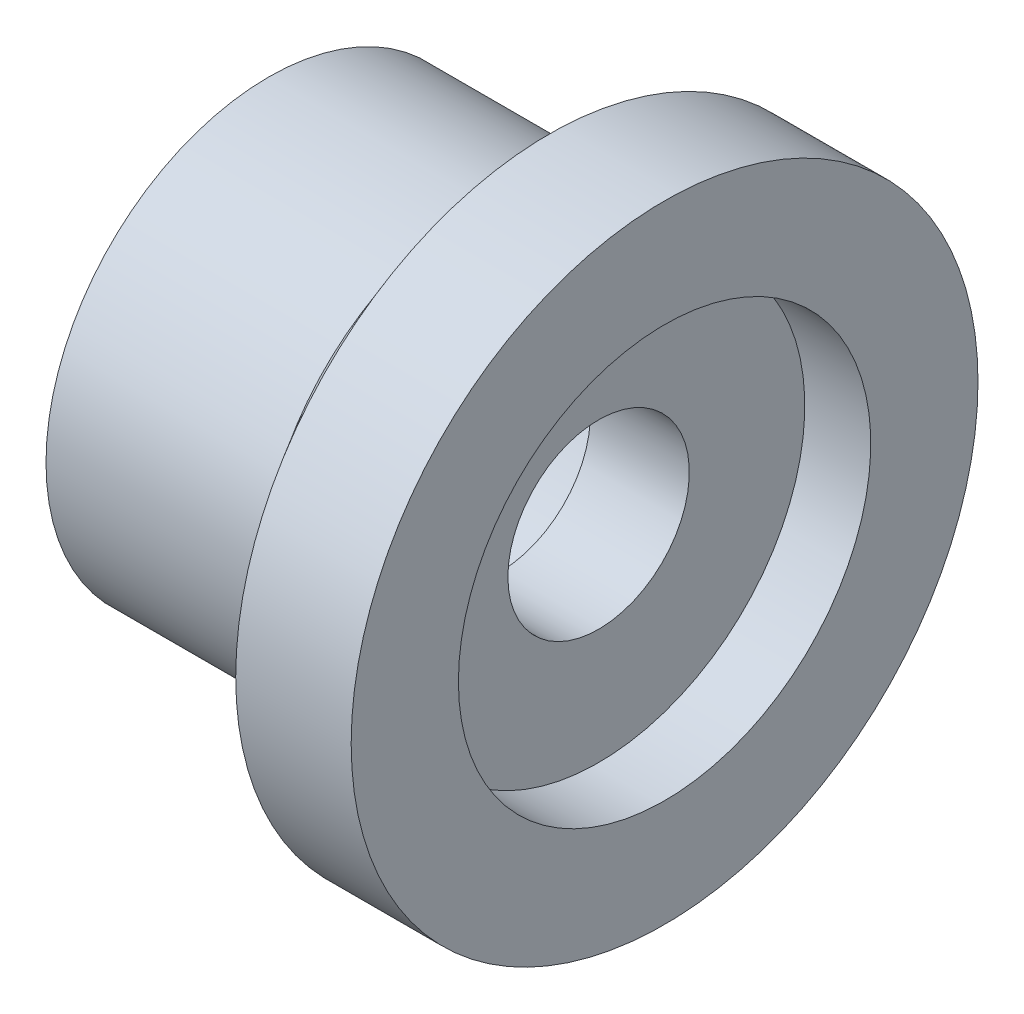
ISO-10303-21;
HEADER;
FILE_DESCRIPTION(('STEP AP214'),'2;1');
FILE_NAME('part.step','',(''),(''),'','','');
FILE_SCHEMA(('AUTOMOTIVE_DESIGN { 1 0 10303 214 1 1 1 1 }'));
ENDSEC;
DATA;
#1=APPLICATION_CONTEXT('core data for automotive mechanical design processes');
#2=APPLICATION_PROTOCOL_DEFINITION('international standard','automotive_design',2000,#1);
#3=PRODUCT_CONTEXT('',#1,'mechanical');
#4=PRODUCT('Part','Part','',(#3));
#5=PRODUCT_RELATED_PRODUCT_CATEGORY('part','',(#4));
#6=PRODUCT_DEFINITION_FORMATION('','',#4);
#7=PRODUCT_DEFINITION_CONTEXT('part definition',#1,'design');
#8=PRODUCT_DEFINITION('design','',#6,#7);
#9=PRODUCT_DEFINITION_SHAPE('','',#8);
#10=(LENGTH_UNIT() NAMED_UNIT(*) SI_UNIT(.MILLI.,.METRE.));
#11=(NAMED_UNIT(*) PLANE_ANGLE_UNIT() SI_UNIT($,.RADIAN.));
#12=(NAMED_UNIT(*) SI_UNIT($,.STERADIAN.) SOLID_ANGLE_UNIT());
#13=UNCERTAINTY_MEASURE_WITH_UNIT(LENGTH_MEASURE(1.E-05),#10,'distance_accuracy_value','');
#14=(GEOMETRIC_REPRESENTATION_CONTEXT(3) GLOBAL_UNCERTAINTY_ASSIGNED_CONTEXT((#13)) GLOBAL_UNIT_ASSIGNED_CONTEXT((#10,
#11,#12)) REPRESENTATION_CONTEXT('',''));
#15=CARTESIAN_POINT('',(0.,0.,0.));
#16=DIRECTION('',(0.,0.,1.));
#17=DIRECTION('',(1.,0.,0.));
#18=AXIS2_PLACEMENT_3D('',#15,#16,#17);
#19=CARTESIAN_POINT('',(-5.00000000000002,5.25000000000003,0.));
#20=DIRECTION('',(1.,0.,0.));
#21=DIRECTION('',(0.,0.,-1.));
#22=AXIS2_PLACEMENT_3D('',#19,#20,#21);
#23=PLANE('',#22);
#24=CARTESIAN_POINT('',(-5.00000000000001,0.,0.));
#25=DIRECTION('',(-1.,0.,0.));
#26=DIRECTION('',(0.,0.,1.));
#27=AXIS2_PLACEMENT_3D('',#24,#25,#26);
#28=CIRCLE('',#27,2.75);
#29=CARTESIAN_POINT('',(-5.00000000000001,0.,2.75));
#30=VERTEX_POINT('',#29);
#31=EDGE_CURVE('E10',#30,#30,#28,.T.);
#32=ORIENTED_EDGE('',*,*,#31,.F.);
#33=EDGE_LOOP('',(#32));
#34=FACE_BOUND('',#33,.T.);
#35=CARTESIAN_POINT('',(-5.00000000000001,0.,0.));
#36=DIRECTION('',(-1.,0.,0.));
#37=DIRECTION('',(0.,0.,1.));
#38=AXIS2_PLACEMENT_3D('',#35,#36,#37);
#39=CIRCLE('',#38,5.25);
#40=CARTESIAN_POINT('',(-5.00000000000001,0.,5.25));
#41=VERTEX_POINT('',#40);
#42=EDGE_CURVE('E58',#41,#41,#39,.T.);
#43=ORIENTED_EDGE('',*,*,#42,.T.);
#44=EDGE_LOOP('',(#43));
#45=FACE_BOUND('',#44,.T.);
#46=ADVANCED_FACE('F24',(#34,#45),#23,.F.);
#47=CARTESIAN_POINT('',(-19.9111605684798,0.,0.));
#48=DIRECTION('',(-1.,0.,0.));
#49=DIRECTION('',(0.,0.,1.));
#50=AXIS2_PLACEMENT_3D('',#47,#48,#49);
#51=CYLINDRICAL_SURFACE('',#50,2.75);
#52=CARTESIAN_POINT('',(-2.,0.,0.));
#53=DIRECTION('',(-1.,0.,0.));
#54=DIRECTION('',(0.,0.,1.));
#55=AXIS2_PLACEMENT_3D('',#52,#53,#54);
#56=CIRCLE('',#55,2.75);
#57=CARTESIAN_POINT('',(-2.,0.,2.75));
#58=VERTEX_POINT('',#57);
#59=EDGE_CURVE('E30',#58,#58,#56,.T.);
#60=ORIENTED_EDGE('',*,*,#59,.F.);
#61=EDGE_LOOP('',(#60));
#62=FACE_BOUND('',#61,.T.);
#63=ORIENTED_EDGE('',*,*,#31,.T.);
#64=EDGE_LOOP('',(#63));
#65=FACE_BOUND('',#64,.T.);
#66=ADVANCED_FACE('F107',(#62,#65),#51,.F.);
#67=CARTESIAN_POINT('',(-2.,2.74999999999997,0.));
#68=DIRECTION('',(-1.,0.,0.));
#69=DIRECTION('',(0.,0.,1.));
#70=AXIS2_PLACEMENT_3D('',#67,#68,#69);
#71=PLANE('',#70);
#72=CARTESIAN_POINT('',(-2.,0.,0.));
#73=DIRECTION('',(-1.,0.,0.));
#74=DIRECTION('',(0.,0.,1.));
#75=AXIS2_PLACEMENT_3D('',#72,#73,#74);
#76=CIRCLE('',#75,6.25);
#77=CARTESIAN_POINT('',(-2.,0.,6.25));
#78=VERTEX_POINT('',#77);
#79=EDGE_CURVE('E34',#78,#78,#76,.T.);
#80=ORIENTED_EDGE('',*,*,#79,.F.);
#81=EDGE_LOOP('',(#80));
#82=FACE_BOUND('',#81,.T.);
#83=ORIENTED_EDGE('',*,*,#59,.T.);
#84=EDGE_LOOP('',(#83));
#85=FACE_BOUND('',#84,.T.);
#86=ADVANCED_FACE('F102',(#82,#85),#71,.F.);
#87=CARTESIAN_POINT('',(-19.9111605684798,0.,0.));
#88=DIRECTION('',(-1.,0.,0.));
#89=DIRECTION('',(0.,0.,1.));
#90=AXIS2_PLACEMENT_3D('',#87,#88,#89);
#91=CYLINDRICAL_SURFACE('',#90,6.25);
#92=CARTESIAN_POINT('',(0.,0.,0.));
#93=DIRECTION('',(-1.,0.,0.));
#94=DIRECTION('',(0.,0.,1.));
#95=AXIS2_PLACEMENT_3D('',#92,#93,#94);
#96=CIRCLE('',#95,6.25);
#97=CARTESIAN_POINT('',(0.,0.,6.25));
#98=VERTEX_POINT('',#97);
#99=EDGE_CURVE('E38',#98,#98,#96,.T.);
#100=ORIENTED_EDGE('',*,*,#99,.F.);
#101=EDGE_LOOP('',(#100));
#102=FACE_BOUND('',#101,.T.);
#103=ORIENTED_EDGE('',*,*,#79,.T.);
#104=EDGE_LOOP('',(#103));
#105=FACE_BOUND('',#104,.T.);
#106=ADVANCED_FACE('F96',(#102,#105),#91,.F.);
#107=CARTESIAN_POINT('',(0.,6.24999999999998,0.));
#108=DIRECTION('',(-1.,0.,0.));
#109=DIRECTION('',(0.,0.,1.));
#110=AXIS2_PLACEMENT_3D('',#107,#108,#109);
#111=PLANE('',#110);
#112=CARTESIAN_POINT('',(0.,0.,0.));
#113=DIRECTION('',(-1.,0.,0.));
#114=DIRECTION('',(0.,0.,1.));
#115=AXIS2_PLACEMENT_3D('',#112,#113,#114);
#116=CIRCLE('',#115,9.5);
#117=CARTESIAN_POINT('',(0.,0.,9.5));
#118=VERTEX_POINT('',#117);
#119=EDGE_CURVE('E43',#118,#118,#116,.T.);
#120=ORIENTED_EDGE('',*,*,#119,.F.);
#121=EDGE_LOOP('',(#120));
#122=FACE_BOUND('',#121,.T.);
#123=ORIENTED_EDGE('',*,*,#99,.T.);
#124=EDGE_LOOP('',(#123));
#125=FACE_BOUND('',#124,.T.);
#126=ADVANCED_FACE('F90',(#122,#125),#111,.F.);
#127=CARTESIAN_POINT('',(-19.9111605684798,0.,0.));
#128=DIRECTION('',(-1.,0.,0.));
#129=DIRECTION('',(0.,0.,1.));
#130=AXIS2_PLACEMENT_3D('',#127,#128,#129);
#131=CYLINDRICAL_SURFACE('',#130,9.5);
#132=CARTESIAN_POINT('',(-3.5,0.,0.));
#133=DIRECTION('',(-1.,0.,0.));
#134=DIRECTION('',(0.,0.,1.));
#135=AXIS2_PLACEMENT_3D('',#132,#133,#134);
#136=CIRCLE('',#135,9.5);
#137=CARTESIAN_POINT('',(-3.5,0.,9.5));
#138=VERTEX_POINT('',#137);
#139=EDGE_CURVE('E46',#138,#138,#136,.T.);
#140=ORIENTED_EDGE('',*,*,#139,.F.);
#141=EDGE_LOOP('',(#140));
#142=FACE_BOUND('',#141,.T.);
#143=ORIENTED_EDGE('',*,*,#119,.T.);
#144=EDGE_LOOP('',(#143));
#145=FACE_BOUND('',#144,.T.);
#146=ADVANCED_FACE('F84',(#142,#145),#131,.T.);
#147=CARTESIAN_POINT('',(-3.5,0.,0.));
#148=DIRECTION('',(1.,0.,0.));
#149=DIRECTION('',(0.,0.,-1.));
#150=AXIS2_PLACEMENT_3D('',#147,#148,#149);
#151=CONICAL_SURFACE('',#150,9.5,0.942000040379463);
#152=CARTESIAN_POINT('',(-5.50000000000001,0.,0.));
#153=DIRECTION('',(-1.,0.,0.));
#154=DIRECTION('',(0.,0.,1.));
#155=AXIS2_PLACEMENT_3D('',#152,#153,#154);
#156=CIRCLE('',#155,6.75);
#157=CARTESIAN_POINT('',(-5.50000000000001,0.,6.75));
#158=VERTEX_POINT('',#157);
#159=EDGE_CURVE('E49',#158,#158,#156,.T.);
#160=ORIENTED_EDGE('',*,*,#159,.F.);
#161=EDGE_LOOP('',(#160));
#162=FACE_BOUND('',#161,.T.);
#163=ORIENTED_EDGE('',*,*,#139,.T.);
#164=EDGE_LOOP('',(#163));
#165=FACE_BOUND('',#164,.T.);
#166=ADVANCED_FACE('F78',(#162,#165),#151,.T.);
#167=CARTESIAN_POINT('',(-19.9111605684798,0.,0.));
#168=DIRECTION('',(-1.,0.,0.));
#169=DIRECTION('',(0.,0.,1.));
#170=AXIS2_PLACEMENT_3D('',#167,#168,#169);
#171=CYLINDRICAL_SURFACE('',#170,6.75);
#172=CARTESIAN_POINT('',(-12.,0.,0.));
#173=DIRECTION('',(-1.,0.,0.));
#174=DIRECTION('',(0.,0.,1.));
#175=AXIS2_PLACEMENT_3D('',#172,#173,#174);
#176=CIRCLE('',#175,6.75);
#177=CARTESIAN_POINT('',(-12.,0.,6.75));
#178=VERTEX_POINT('',#177);
#179=EDGE_CURVE('E52',#178,#178,#176,.T.);
#180=ORIENTED_EDGE('',*,*,#179,.F.);
#181=EDGE_LOOP('',(#180));
#182=FACE_BOUND('',#181,.T.);
#183=ORIENTED_EDGE('',*,*,#159,.T.);
#184=EDGE_LOOP('',(#183));
#185=FACE_BOUND('',#184,.T.);
#186=ADVANCED_FACE('F72',(#182,#185),#171,.T.);
#187=CARTESIAN_POINT('',(-12.,6.74999999999998,0.));
#188=DIRECTION('',(1.,0.,0.));
#189=DIRECTION('',(0.,0.,-1.));
#190=AXIS2_PLACEMENT_3D('',#187,#188,#189);
#191=PLANE('',#190);
#192=CARTESIAN_POINT('',(-12.,0.,0.));
#193=DIRECTION('',(-1.,0.,0.));
#194=DIRECTION('',(0.,0.,1.));
#195=AXIS2_PLACEMENT_3D('',#192,#193,#194);
#196=CIRCLE('',#195,5.25);
#197=CARTESIAN_POINT('',(-12.,0.,5.25));
#198=VERTEX_POINT('',#197);
#199=EDGE_CURVE('E55',#198,#198,#196,.T.);
#200=ORIENTED_EDGE('',*,*,#199,.F.);
#201=EDGE_LOOP('',(#200));
#202=FACE_BOUND('',#201,.T.);
#203=ORIENTED_EDGE('',*,*,#179,.T.);
#204=EDGE_LOOP('',(#203));
#205=FACE_BOUND('',#204,.T.);
#206=ADVANCED_FACE('F66',(#202,#205),#191,.F.);
#207=CARTESIAN_POINT('',(-19.9111605684798,0.,0.));
#208=DIRECTION('',(-1.,0.,0.));
#209=DIRECTION('',(0.,0.,1.));
#210=AXIS2_PLACEMENT_3D('',#207,#208,#209);
#211=CYLINDRICAL_SURFACE('',#210,5.25);
#212=ORIENTED_EDGE('',*,*,#42,.F.);
#213=EDGE_LOOP('',(#212));
#214=FACE_BOUND('',#213,.T.);
#215=ORIENTED_EDGE('',*,*,#199,.T.);
#216=EDGE_LOOP('',(#215));
#217=FACE_BOUND('',#216,.T.);
#218=ADVANCED_FACE('F63',(#214,#217),#211,.F.);
#219=CLOSED_SHELL('',(#46,#66,#86,#106,#126,#146,#166,#186,#206,#218));
#220=MANIFOLD_SOLID_BREP('B2',#219);
#221=ADVANCED_BREP_SHAPE_REPRESENTATION('',(#18,#220),#14);
#222=SHAPE_DEFINITION_REPRESENTATION(#9,#221);
ENDSEC;
END-ISO-10303-21;
